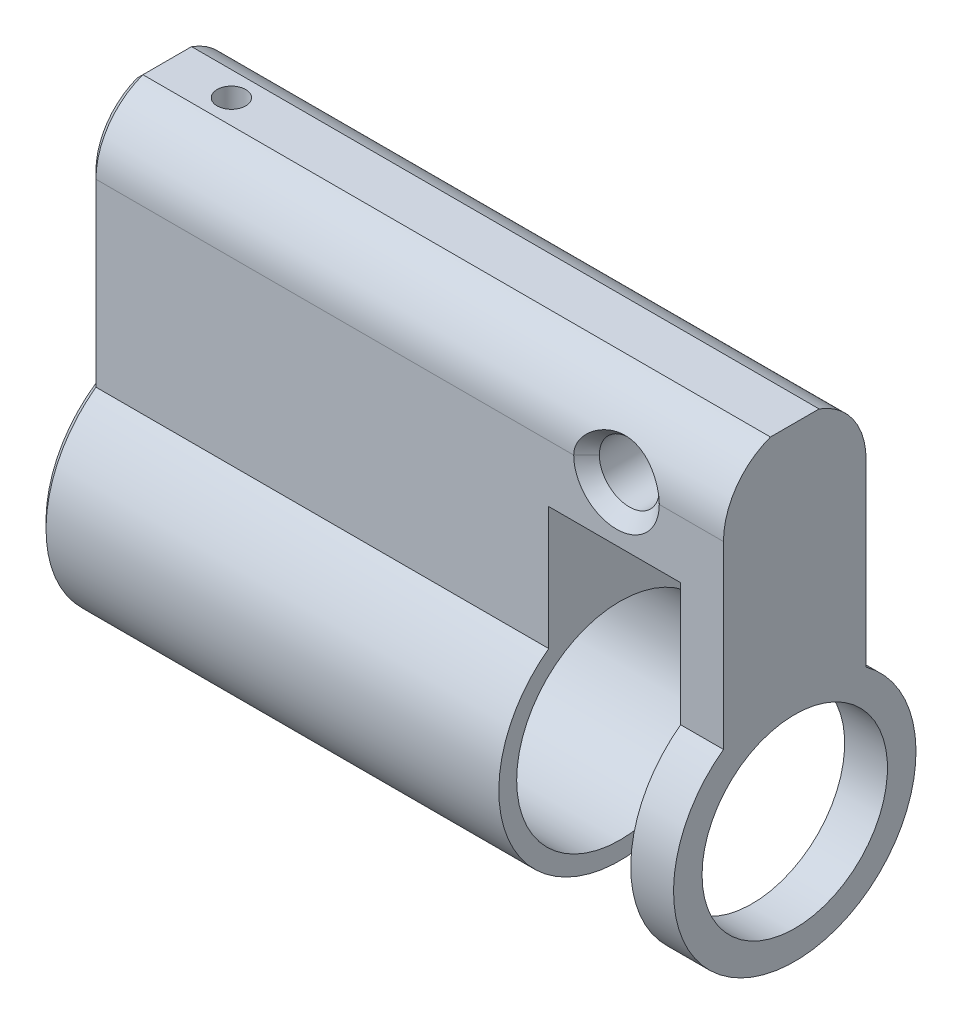
ISO-10303-21;
HEADER;
FILE_DESCRIPTION(('STEP AP214'),'2;1');
FILE_NAME('part.step','',(''),(''),'','','');
FILE_SCHEMA(('AUTOMOTIVE_DESIGN { 1 0 10303 214 1 1 1 1 }'));
ENDSEC;
DATA;
#1=APPLICATION_CONTEXT('core data for automotive mechanical design processes');
#2=APPLICATION_PROTOCOL_DEFINITION('international standard','automotive_design',2000,#1);
#3=PRODUCT_CONTEXT('',#1,'mechanical');
#4=PRODUCT('Part','Part','',(#3));
#5=PRODUCT_RELATED_PRODUCT_CATEGORY('part','',(#4));
#6=PRODUCT_DEFINITION_FORMATION('','',#4);
#7=PRODUCT_DEFINITION_CONTEXT('part definition',#1,'design');
#8=PRODUCT_DEFINITION('design','',#6,#7);
#9=PRODUCT_DEFINITION_SHAPE('','',#8);
#10=(LENGTH_UNIT() NAMED_UNIT(*) SI_UNIT(.MILLI.,.METRE.));
#11=(NAMED_UNIT(*) PLANE_ANGLE_UNIT() SI_UNIT($,.RADIAN.));
#12=(NAMED_UNIT(*) SI_UNIT($,.STERADIAN.) SOLID_ANGLE_UNIT());
#13=UNCERTAINTY_MEASURE_WITH_UNIT(LENGTH_MEASURE(1.E-05),#10,'distance_accuracy_value','');
#14=(GEOMETRIC_REPRESENTATION_CONTEXT(3) GLOBAL_UNCERTAINTY_ASSIGNED_CONTEXT((#13)) GLOBAL_UNIT_ASSIGNED_CONTEXT((#10,
#11,#12)) REPRESENTATION_CONTEXT('',''));
#15=CARTESIAN_POINT('',(0.,0.,0.));
#16=DIRECTION('',(0.,0.,1.));
#17=DIRECTION('',(1.,0.,0.));
#18=AXIS2_PLACEMENT_3D('',#15,#16,#17);
#19=CARTESIAN_POINT('',(37.,19.5,5.));
#20=DIRECTION('',(0.,0.,1.));
#21=DIRECTION('',(1.,0.,0.));
#22=AXIS2_PLACEMENT_3D('',#19,#20,#21);
#23=CYLINDRICAL_SURFACE('',#22,2.1);
#24=CARTESIAN_POINT('',(37.,19.5,4.09999999993715));
#25=DIRECTION('',(0.,0.,1.));
#26=DIRECTION('',(1.,0.,0.));
#27=AXIS2_PLACEMENT_3D('',#24,#25,#26);
#28=CIRCLE('',#27,2.10000000001901);
#29=CARTESIAN_POINT('',(34.9000000000172,19.5,4.09999999990873));
#30=VERTEX_POINT('',#29);
#31=CARTESIAN_POINT('',(39.0999999999858,19.5,4.09999999991821));
#32=VERTEX_POINT('',#31);
#33=EDGE_CURVE('E288',#30,#32,#28,.T.);
#34=ORIENTED_EDGE('',*,*,#33,.T.);
#35=CARTESIAN_POINT('',(37.,19.5,4.09999999993715));
#36=DIRECTION('',(0.,0.,1.));
#37=DIRECTION('',(1.,0.,0.));
#38=AXIS2_PLACEMENT_3D('',#35,#36,#37);
#39=CIRCLE('',#38,2.10000000001901);
#40=EDGE_CURVE('E284',#32,#30,#39,.T.);
#41=ORIENTED_EDGE('',*,*,#40,.T.);
#42=EDGE_LOOP('',(#34,#41));
#43=FACE_BOUND('',#42,.T.);
#44=CARTESIAN_POINT('',(37.,19.5,-4.10000000005084));
#45=DIRECTION('',(0.,0.,-1.));
#46=DIRECTION('',(-1.,0.,0.));
#47=AXIS2_PLACEMENT_3D('',#44,#45,#46);
#48=CIRCLE('',#47,2.10000000006357);
#49=CARTESIAN_POINT('',(34.8999999999364,19.5,-4.10000000005084));
#50=VERTEX_POINT('',#49);
#51=EDGE_CURVE('E283',#50,#50,#48,.T.);
#52=ORIENTED_EDGE('',*,*,#51,.T.);
#53=EDGE_LOOP('',(#52));
#54=FACE_BOUND('',#53,.T.);
#55=ADVANCED_FACE('F17',(#43,#54),#23,.F.);
#56=CARTESIAN_POINT('',(44.5,0.,0.));
#57=DIRECTION('',(-1.,0.,0.));
#58=DIRECTION('',(0.,0.,1.));
#59=AXIS2_PLACEMENT_3D('',#56,#57,#58);
#60=CYLINDRICAL_SURFACE('',#59,6.5);
#61=CARTESIAN_POINT('',(44.5,0.,0.));
#62=DIRECTION('',(-1.,0.,0.));
#63=DIRECTION('',(0.,0.,1.));
#64=AXIS2_PLACEMENT_3D('',#61,#62,#63);
#65=CIRCLE('',#64,6.5);
#66=CARTESIAN_POINT('',(44.5,0.,6.5));
#67=VERTEX_POINT('',#66);
#68=EDGE_CURVE('E291',#67,#67,#65,.T.);
#69=ORIENTED_EDGE('',*,*,#68,.F.);
#70=EDGE_LOOP('',(#69));
#71=FACE_BOUND('',#70,.T.);
#72=CARTESIAN_POINT('',(41.5,0.,0.));
#73=DIRECTION('',(-1.,0.,0.));
#74=DIRECTION('',(0.,0.,1.));
#75=AXIS2_PLACEMENT_3D('',#72,#73,#74);
#76=CIRCLE('',#75,6.5);
#77=CARTESIAN_POINT('',(41.5,0.,6.5));
#78=VERTEX_POINT('',#77);
#79=EDGE_CURVE('E420',#78,#78,#76,.T.);
#80=ORIENTED_EDGE('',*,*,#79,.T.);
#81=EDGE_LOOP('',(#80));
#82=FACE_BOUND('',#81,.T.);
#83=ADVANCED_FACE('F376',(#71,#82),#60,.F.);
#84=CARTESIAN_POINT('',(37.,19.5,5.00539999984539));
#85=DIRECTION('',(0.,0.,1.));
#86=DIRECTION('',(1.,0.,0.));
#87=AXIS2_PLACEMENT_3D('',#84,#85,#86);
#88=CONICAL_SURFACE('',#87,3.00539999992725,0.78539816342884);
#89=ORIENTED_EDGE('',*,*,#40,.F.);
#90=DIRECTION('',(-0.70710678118655,0.,-0.707106781186546));
#91=VECTOR('',#90,1.);
#92=CARTESIAN_POINT('',(499000.,19.5,498964.999999997));
#93=LINE('',#92,#91);
#94=CARTESIAN_POINT('',(40.0000000000489,19.5,4.99999999999659));
#95=VERTEX_POINT('',#94);
#96=EDGE_CURVE('E426',#32,#95,#93,.F.);
#97=ORIENTED_EDGE('',*,*,#96,.T.);
#98=CARTESIAN_POINT('',(33.9999999999199,19.5,5.00000000000343));
#99=CARTESIAN_POINT('',(33.9999854146605,19.5528225823414,5.00000822978084));
#100=CARTESIAN_POINT('',(34.0022316938853,19.6056363700975,4.99916317729062));
#101=CARTESIAN_POINT('',(34.0111336406359,19.7108042339211,4.99582883745809));
#102=CARTESIAN_POINT('',(34.0177863449553,19.7631585949841,4.99334065508124));
#103=CARTESIAN_POINT('',(34.0353228534764,19.8666467403166,4.98680690474662));
#104=CARTESIAN_POINT('',(34.0461744451081,19.9177867445114,4.98277319584288));
#105=CARTESIAN_POINT('',(34.0719065568968,20.0188969298868,4.97326134082751));
#106=CARTESIAN_POINT('',(34.086787584622,20.0688669628297,4.96778301274657));
#107=CARTESIAN_POINT('',(34.137044390166,20.2163089994117,4.94941046813956));
#108=CARTESIAN_POINT('',(34.1780947807403,20.3116589926914,4.93455541766174));
#109=CARTESIAN_POINT('',(34.2731694972842,20.4949890173285,4.90089186162958));
#110=CARTESIAN_POINT('',(34.3272223849256,20.5829522406904,4.88207466421134));
#111=CARTESIAN_POINT('',(34.4714837219082,20.7863295147732,4.83326618091879));
#112=CARTESIAN_POINT('',(34.5672837757614,20.8974678671354,4.80193027192794));
#113=CARTESIAN_POINT('',(34.7756046713651,21.1021289189596,4.73758854489772));
#114=CARTESIAN_POINT('',(34.8881491989768,21.1956262323526,4.70458040575029));
#115=CARTESIAN_POINT('',(35.1282371661669,21.3665847421425,4.63943668619313));
#116=CARTESIAN_POINT('',(35.2560159514255,21.4437237443117,4.60732785243984));
#117=CARTESIAN_POINT('',(35.5217473279444,21.5798726188792,4.54748903850474));
#118=CARTESIAN_POINT('',(35.6596985534591,21.6388849194817,4.51975847206407));
#119=CARTESIAN_POINT('',(35.9713431620296,21.7486084129189,4.46634401069456));
#120=CARTESIAN_POINT('',(36.1467057827306,21.7953633575503,4.44215213999822));
#121=CARTESIAN_POINT('',(36.5037480064608,21.8621924647062,4.40698192873602));
#122=CARTESIAN_POINT('',(36.6854283214082,21.8822636102667,4.39600508232041));
#123=CARTESIAN_POINT('',(37.0527229313458,21.8954235403674,4.38885154307643));
#124=CARTESIAN_POINT('',(37.2383560516724,21.8881164672787,4.39289197614788));
#125=CARTESIAN_POINT('',(37.6055591510559,21.8457803393038,4.41563917308225));
#126=CARTESIAN_POINT('',(37.7871275307215,21.8107405626823,4.43435160925938));
#127=CARTESIAN_POINT('',(38.139816415752,21.7138667062694,4.48349171625867));
#128=CARTESIAN_POINT('',(38.3110032388125,21.6522291263898,4.51383329269228));
#129=CARTESIAN_POINT('',(38.6398475026852,21.5025376092208,4.58220504349375));
#130=CARTESIAN_POINT('',(38.7975062049494,21.4144861383881,4.62023449988036));
#131=CARTESIAN_POINT('',(39.0671706908479,21.230266785056,4.69191714371968));
#132=CARTESIAN_POINT('',(39.1822749412107,21.1384514179893,4.72511683677503));
#133=CARTESIAN_POINT('',(39.396062736459,20.9369322899441,4.7902399688264));
#134=CARTESIAN_POINT('',(39.4947692252981,20.8272539562345,4.82216514277619));
#135=CARTESIAN_POINT('',(39.650882269423,20.6172015241567,4.87450403285088));
#136=CARTESIAN_POINT('',(39.7125852404604,20.5202741691004,4.89589248736086));
#137=CARTESIAN_POINT('',(39.8199820183252,20.3172337904155,4.93383613165072));
#138=CARTESIAN_POINT('',(39.8657181117365,20.2111459723621,4.95040406835083));
#139=CARTESIAN_POINT('',(39.9338143223749,20.0053941913842,4.9753313485891));
#140=CARTESIAN_POINT('',(39.9583675607026,19.906561145412,4.98445303847158));
#141=CARTESIAN_POINT('',(39.9832058671073,19.7557661161589,4.99371206292589));
#142=CARTESIAN_POINT('',(39.9894874544757,19.7048726929359,4.99606155342167));
#143=CARTESIAN_POINT('',(39.9978897125291,19.6026614748258,4.99920846538627));
#144=CARTESIAN_POINT('',(40.0000075163128,19.5513434119576,5.00000481746539));
#145=CARTESIAN_POINT('',(40.0000000000815,19.5,5.));
#146=B_SPLINE_CURVE_WITH_KNOTS('',3,(#98,#99,#100,#101,#102,#103,#104,#105,#106,#107,#108,#109,
#110,#111,#112,#113,#114,#115,#116,#117,#118,#119,#120,#121,#122,#123,#124,#125,#126,#127,#128,
#129,#130,#131,#132,#133,#134,#135,#136,#137,#138,#139,#140,#141,#142,#143,#144,#145),
.UNSPECIFIED.,.F.,.F.,(4,2,2,2,2,2,2,2,2,2,2,2,2,2,2,2,2,2,2,2,2,2,2,4),(0.,0.158398883151843,
0.31669135517533,0.473792792210861,0.630914027757754,0.944113013268993,1.25800636640073,
1.70566148017339,2.15395595241382,2.61039478058119,3.06677243873736,3.6135000563763,
4.16028948370242,4.71501516214164,5.2699554077907,5.82086421799829,6.3717216018545,
6.82289045807166,7.27342261688,7.62272317367181,7.9710914991915,8.27632758411876,
8.43015406623447,8.58408642588058),.UNSPECIFIED.);
#147=CARTESIAN_POINT('',(33.9999999999947,19.5,4.99999999996931));
#148=VERTEX_POINT('',#147);
#149=EDGE_CURVE('E272',#148,#95,#146,.T.);
#150=ORIENTED_EDGE('',*,*,#149,.F.);
#151=DIRECTION('',(0.70710678118655,0.,-0.707106781186546));
#152=VECTOR('',#151,1.);
#153=CARTESIAN_POINT('',(-498926.,19.5000000000611,498964.999999997));
#154=LINE('',#153,#152);
#155=EDGE_CURVE('E292',#148,#30,#154,.T.);
#156=ORIENTED_EDGE('',*,*,#155,.T.);
#157=EDGE_LOOP('',(#89,#97,#150,#156));
#158=FACE_BOUND('',#157,.T.);
#159=ADVANCED_FACE('F370',(#158),#88,.F.);
#160=CARTESIAN_POINT('',(44.5,24.2,1.7058722109232));
#161=DIRECTION('',(0.,-1.,0.));
#162=DIRECTION('',(0.,0.,-1.));
#163=AXIS2_PLACEMENT_3D('',#160,#161,#162);
#164=PLANE('',#163);
#165=DIRECTION('',(0.,0.,1.));
#166=VECTOR('',#165,1.);
#167=CARTESIAN_POINT('',(0.500000000000007,24.2,1.7058722109232));
#168=LINE('',#167,#166);
#169=CARTESIAN_POINT('',(0.500000000030796,24.2000000000083,-1.70587221085203));
#170=VERTEX_POINT('',#169);
#171=CARTESIAN_POINT('',(0.500000000014491,24.2000000000145,1.70587221085312));
#172=VERTEX_POINT('',#171);
#173=EDGE_CURVE('E274',#170,#172,#168,.T.);
#174=ORIENTED_EDGE('',*,*,#173,.T.);
#175=DIRECTION('',(-1.,0.,0.));
#176=VECTOR('',#175,1.);
#177=CARTESIAN_POINT('',(44.5,24.2,1.7058722109232));
#178=LINE('',#177,#176);
#179=CARTESIAN_POINT('',(44.5,24.2,1.7058722109232));
#180=VERTEX_POINT('',#179);
#181=EDGE_CURVE('E269',#180,#172,#178,.T.);
#182=ORIENTED_EDGE('',*,*,#181,.F.);
#183=DIRECTION('',(0.,0.,-1.));
#184=VECTOR('',#183,1.);
#185=CARTESIAN_POINT('',(44.5,24.2,0.));
#186=LINE('',#185,#184);
#187=CARTESIAN_POINT('',(44.5,24.2,-1.7058722109232));
#188=VERTEX_POINT('',#187);
#189=EDGE_CURVE('E409',#188,#180,#186,.F.);
#190=ORIENTED_EDGE('',*,*,#189,.F.);
#191=DIRECTION('',(-1.,0.,0.));
#192=VECTOR('',#191,1.);
#193=CARTESIAN_POINT('',(44.5,24.2,-1.7058722109232));
#194=LINE('',#193,#192);
#195=EDGE_CURVE('E281',#170,#188,#194,.F.);
#196=ORIENTED_EDGE('',*,*,#195,.F.);
#197=EDGE_LOOP('',(#174,#182,#190,#196));
#198=FACE_BOUND('',#197,.T.);
#199=CARTESIAN_POINT('',(5.,24.2,0.));
#200=DIRECTION('',(0.,-1.,0.));
#201=DIRECTION('',(0.,0.,-1.));
#202=AXIS2_PLACEMENT_3D('',#199,#200,#201);
#203=CIRCLE('',#202,1.);
#204=CARTESIAN_POINT('',(5.,24.2,-1.));
#205=VERTEX_POINT('',#204);
#206=EDGE_CURVE('E428',#205,#205,#203,.T.);
#207=ORIENTED_EDGE('',*,*,#206,.T.);
#208=EDGE_LOOP('',(#207));
#209=FACE_BOUND('',#208,.T.);
#210=ADVANCED_FACE('F375',(#198,#209),#164,.F.);
#211=CARTESIAN_POINT('',(37.,19.5,-4.99999999988177));
#212=DIRECTION('',(0.,0.,-1.));
#213=DIRECTION('',(-1.,0.,0.));
#214=AXIS2_PLACEMENT_3D('',#211,#212,#213);
#215=CONICAL_SURFACE('',#214,2.9999999998945,0.785398163397448);
#216=CARTESIAN_POINT('',(37.,19.5,-4.99999999999545));
#217=DIRECTION('',(0.,0.,-1.));
#218=DIRECTION('',(-1.,0.,0.));
#219=AXIS2_PLACEMENT_3D('',#216,#217,#218);
#220=CIRCLE('',#219,3.00000000000818);
#221=CARTESIAN_POINT('',(39.9999999998826,19.5,-4.99999999989711));
#222=VERTEX_POINT('',#221);
#223=CARTESIAN_POINT('',(34.0000000000314,19.5,-4.99999999996817));
#224=VERTEX_POINT('',#223);
#225=EDGE_CURVE('E110',#222,#224,#220,.T.);
#226=ORIENTED_EDGE('',*,*,#225,.T.);
#227=CARTESIAN_POINT('',(40.0000000000127,19.5,-5.));
#228=CARTESIAN_POINT('',(40.0000145852713,19.5528225823416,-5.00000822977961));
#229=CARTESIAN_POINT('',(39.997768306046,19.6056363700979,-4.99916317729028));
#230=CARTESIAN_POINT('',(39.9888663592952,19.7108042339218,-4.99582883745839));
#231=CARTESIAN_POINT('',(39.9822136549759,19.7631585949851,-4.99334065508128));
#232=CARTESIAN_POINT('',(39.9646771464549,19.866646740318,-4.98680690474643));
#233=CARTESIAN_POINT('',(39.9538255548231,19.917786744513,-4.98277319584272));
#234=CARTESIAN_POINT('',(39.9280934430345,20.0188969298888,-4.97326134082732));
#235=CARTESIAN_POINT('',(39.9132124153093,20.068866962832,-4.96778301274632));
#236=CARTESIAN_POINT('',(39.8629556097652,20.2163089994146,-4.94941046813913));
#237=CARTESIAN_POINT('',(39.8219052191909,20.3116589926948,-4.93455541766119));
#238=CARTESIAN_POINT('',(39.7268305026468,20.4949890173327,-4.90089186162873));
#239=CARTESIAN_POINT('',(39.6727776150052,20.582952240695,-4.88207466421032));
#240=CARTESIAN_POINT('',(39.5285162780233,20.786329514777,-4.83326618091775));
#241=CARTESIAN_POINT('',(39.4327162241711,20.8974678671381,-4.80193027192712));
#242=CARTESIAN_POINT('',(39.2243953285695,21.1021289189604,-4.73758854489743));
#243=CARTESIAN_POINT('',(39.1118508009589,21.1956262323525,-4.70458040575031));
#244=CARTESIAN_POINT('',(38.8717628337712,21.3665847421403,-4.63943668619396));
#245=CARTESIAN_POINT('',(38.743984048514,21.4437237443084,-4.60732785244118));
#246=CARTESIAN_POINT('',(38.4782526719978,21.5798726188737,-4.54748903850722));
#247=CARTESIAN_POINT('',(38.3403014464845,21.6388849194751,-4.51975847206719));
#248=CARTESIAN_POINT('',(38.0286568379196,21.7486084129087,-4.46634401069966));
#249=CARTESIAN_POINT('',(37.853294217223,21.795363357538,-4.44215214000455));
#250=CARTESIAN_POINT('',(37.4962519935018,21.8621924646903,-4.40698192874455));
#251=CARTESIAN_POINT('',(37.3145716785591,21.8822636102492,-4.39600508232992));
#252=CARTESIAN_POINT('',(36.9472770686322,21.8954235403472,-4.38885154308748));
#253=CARTESIAN_POINT('',(36.7616439483118,21.8881164672575,-4.39289197615942));
#254=CARTESIAN_POINT('',(36.3944408489406,21.8457803392815,-4.41563917309408));
#255=CARTESIAN_POINT('',(36.2128724692812,21.81074056266,-4.434351609271));
#256=CARTESIAN_POINT('',(35.8601835842628,21.7138667062478,-4.48349171626935));
#257=CARTESIAN_POINT('',(35.6889967612082,21.6522291263689,-4.51383329270222));
#258=CARTESIAN_POINT('',(35.360152497347,21.5025376092023,-4.58220504350183));
#259=CARTESIAN_POINT('',(35.2024937950885,21.4144861383712,-4.62023449988731));
#260=CARTESIAN_POINT('',(34.9328293091977,21.2302667850416,-4.69191714372499));
#261=CARTESIAN_POINT('',(34.8177250588372,21.1384514179754,-4.72511683677987));
#262=CARTESIAN_POINT('',(34.6039372635937,20.9369322899312,-4.79023996883025));
#263=CARTESIAN_POINT('',(34.5052307747569,20.8272539562223,-4.82216514277952));
#264=CARTESIAN_POINT('',(34.3491177306352,20.617201524145,-4.87450403285356));
#265=CARTESIAN_POINT('',(34.2874147595988,20.5202741690884,-4.89589248736338));
#266=CARTESIAN_POINT('',(34.1800179817362,20.3172337904028,-4.93383613165282));
#267=CARTESIAN_POINT('',(34.134281888326,20.2111459723492,-4.95040406835269));
#268=CARTESIAN_POINT('',(34.0661856776903,20.0053941913729,-4.97533134859021));
#269=CARTESIAN_POINT('',(34.0416324393639,19.9065611454028,-4.98445303847228));
#270=CARTESIAN_POINT('',(34.0167941329605,19.755766116153,-4.99371206292618));
#271=CARTESIAN_POINT('',(34.0105125455925,19.7048726929312,-4.99606155342186));
#272=CARTESIAN_POINT('',(34.0021102875396,19.6026614748234,-4.99920846538631));
#273=CARTESIAN_POINT('',(33.999992483756,19.5513434119564,-5.00000481746539));
#274=CARTESIAN_POINT('',(33.9999999999873,19.5,-5.));
#275=B_SPLINE_CURVE_WITH_KNOTS('',3,(#227,#228,#229,#230,#231,#232,#233,#234,#235,#236,#237,
#238,#239,#240,#241,#242,#243,#244,#245,#246,#247,#248,#249,#250,#251,#252,#253,#254,#255,#256,
#257,#258,#259,#260,#261,#262,#263,#264,#265,#266,#267,#268,#269,#270,#271,#272,#273,#274),
.UNSPECIFIED.,.F.,.F.,(4,2,2,2,2,2,2,2,2,2,2,2,2,2,2,2,2,2,2,2,2,2,2,4),(0.,0.158398883152431,
0.316691355176518,0.473792792212691,0.63091402776022,0.944113013272763,1.25800636640578,
1.70566148017409,2.15395595241016,2.61039478057208,3.06677243872281,3.61350005634717,
4.1602894836587,4.71501516207984,5.26995540771078,5.82086421790098,6.37172160173984,
6.82289045795051,7.27342261675239,7.62272317354341,7.97109149906236,8.2763275839828,
8.43015406609496,8.58408642573749),.UNSPECIFIED.);
#276=EDGE_CURVE('E21',#222,#224,#275,.T.);
#277=ORIENTED_EDGE('',*,*,#276,.F.);
#278=EDGE_LOOP('',(#226,#277));
#279=FACE_BOUND('',#278,.T.);
#280=ORIENTED_EDGE('',*,*,#51,.F.);
#281=EDGE_LOOP('',(#280));
#282=FACE_BOUND('',#281,.T.);
#283=ADVANCED_FACE('F489',(#279,#282),#215,.F.);
#284=CARTESIAN_POINT('',(44.5,19.5,0.));
#285=DIRECTION('',(-1.,0.,0.));
#286=DIRECTION('',(0.,0.,1.));
#287=AXIS2_PLACEMENT_3D('',#284,#285,#286);
#288=CYLINDRICAL_SURFACE('',#287,5.);
#289=DIRECTION('',(1.,0.,0.));
#290=VECTOR('',#289,1.);
#291=CARTESIAN_POINT('',(44.5,19.5,-5.));
#292=LINE('',#291,#290);
#293=CARTESIAN_POINT('',(44.5,19.5,-5.));
#294=VERTEX_POINT('',#293);
#295=EDGE_CURVE('E213',#294,#222,#292,.F.);
#296=ORIENTED_EDGE('',*,*,#295,.T.);
#297=ORIENTED_EDGE('',*,*,#276,.T.);
#298=DIRECTION('',(1.,0.,0.));
#299=VECTOR('',#298,1.);
#300=CARTESIAN_POINT('',(44.5,19.5,-5.));
#301=LINE('',#300,#299);
#302=CARTESIAN_POINT('',(0.500000000022514,19.5,-4.99999999999773));
#303=VERTEX_POINT('',#302);
#304=EDGE_CURVE('E207',#224,#303,#301,.F.);
#305=ORIENTED_EDGE('',*,*,#304,.T.);
#306=CARTESIAN_POINT('',(0.50000000004502,19.5,0.));
#307=DIRECTION('',(1.,0.,0.));
#308=DIRECTION('',(0.,0.,-1.));
#309=AXIS2_PLACEMENT_3D('',#306,#307,#308);
#310=CIRCLE('',#309,4.99999999999545);
#311=EDGE_CURVE('E230',#170,#303,#310,.F.);
#312=ORIENTED_EDGE('',*,*,#311,.F.);
#313=ORIENTED_EDGE('',*,*,#195,.T.);
#314=CARTESIAN_POINT('',(44.5,19.5,0.));
#315=DIRECTION('',(-1.,0.,0.));
#316=DIRECTION('',(0.,0.,1.));
#317=AXIS2_PLACEMENT_3D('',#314,#315,#316);
#318=CIRCLE('',#317,5.);
#319=EDGE_CURVE('E416',#294,#188,#318,.F.);
#320=ORIENTED_EDGE('',*,*,#319,.F.);
#321=EDGE_LOOP('',(#296,#297,#305,#312,#313,#320));
#322=FACE_BOUND('',#321,.T.);
#323=ADVANCED_FACE('F447',(#322),#288,.T.);
#324=CARTESIAN_POINT('',(5.,35.,0.));
#325=DIRECTION('',(0.,-1.,0.));
#326=DIRECTION('',(0.,0.,-1.));
#327=AXIS2_PLACEMENT_3D('',#324,#325,#326);
#328=CYLINDRICAL_SURFACE('',#327,1.);
#329=ORIENTED_EDGE('',*,*,#206,.F.);
#330=EDGE_LOOP('',(#329));
#331=FACE_BOUND('',#330,.T.);
#332=CARTESIAN_POINT('',(5.,7.18070330817254,-1.));
#333=CARTESIAN_POINT('',(5.05583092252824,7.18070420570197,-0.999997506706467));
#334=CARTESIAN_POINT('',(5.11173446976674,7.18136201154282,-0.995304779072233));
#335=CARTESIAN_POINT('',(5.22202199965267,7.1839223009072,-0.976650254365614));
#336=CARTESIAN_POINT('',(5.27640259960566,7.18582735643132,-0.96266930281722));
#337=CARTESIAN_POINT('',(5.38197256228186,7.19066240463804,-0.925859795407067));
#338=CARTESIAN_POINT('',(5.43316544636477,7.19359124184075,-0.903041210919993));
#339=CARTESIAN_POINT('',(5.53097288710094,7.20014221161936,-0.849225114023525));
#340=CARTESIAN_POINT('',(5.57758927697457,7.20376406486301,-0.818230895047748));
#341=CARTESIAN_POINT('',(5.66526623272058,7.21132142593411,-0.748712082836381));
#342=CARTESIAN_POINT('',(5.70629076937359,7.21525873004016,-0.710142236079476));
#343=CARTESIAN_POINT('',(5.78130865352364,7.22298742540225,-0.626662894468755));
#344=CARTESIAN_POINT('',(5.81530127930559,7.2267788016486,-0.581752749678083));
#345=CARTESIAN_POINT('',(5.87541639727752,7.2338064638837,-0.486645016443903));
#346=CARTESIAN_POINT('',(5.90150666788128,7.23704045467194,-0.436426877485283));
#347=CARTESIAN_POINT('',(5.9448695594005,7.24256952535023,-0.332269959615617));
#348=CARTESIAN_POINT('',(5.96214265280799,7.24486465555033,-0.278331380250192));
#349=CARTESIAN_POINT('',(5.98727451278554,7.2482449934304,-0.168628174356074));
#350=CARTESIAN_POINT('',(5.99519243776723,7.24933780106679,-0.11287733835884));
#351=CARTESIAN_POINT('',(6.00157270774973,7.25021636609379,-0.000828218561136006));
#352=CARTESIAN_POINT('',(6.00003548461855,7.25000218318176,0.0554700401182938));
#353=CARTESIAN_POINT('',(5.98759617112012,7.24829701300697,0.166612247564157));
#354=CARTESIAN_POINT('',(5.9767577976581,7.24681471310824,0.221463479817656));
#355=CARTESIAN_POINT('',(5.94612348829491,7.24274954674007,0.328561574289506));
#356=CARTESIAN_POINT('',(5.92632727431407,7.24016664610466,0.380808355601572));
#357=CARTESIAN_POINT('',(5.8782719612081,7.23417542571909,0.481410661479399));
#358=CARTESIAN_POINT('',(5.84998538055084,7.23076443256776,0.529752893021716));
#359=CARTESIAN_POINT('',(5.78577472563159,7.2234982994777,0.621024615889332));
#360=CARTESIAN_POINT('',(5.74985083498755,7.219643170218,0.663954237306316));
#361=CARTESIAN_POINT('',(5.67103655780434,7.21188207614354,0.743553924039967));
#362=CARTESIAN_POINT('',(5.62809189378762,7.20797595287442,0.780170246035541));
#363=CARTESIAN_POINT('',(5.53661527448014,7.20058201770957,0.84570097026846));
#364=CARTESIAN_POINT('',(5.48808078661362,7.19709439689708,0.874611861599064));
#365=CARTESIAN_POINT('',(5.38673742735358,7.19093211489438,0.923913396640632));
#366=CARTESIAN_POINT('',(5.33392267964184,7.18825859616053,0.944292081714915));
#367=CARTESIAN_POINT('',(5.22564617801063,7.18404523080903,0.975833625406255));
#368=CARTESIAN_POINT('',(5.17019029176125,7.18250298553394,0.987015989271698));
#369=CARTESIAN_POINT('',(5.09529016075649,7.18131021812896,0.995633398101801));
#370=CARTESIAN_POINT('',(5.07627201577249,7.18108310616462,0.997269612547973));
#371=CARTESIAN_POINT('',(5.03817207755431,7.18077949769804,0.999453340067789));
#372=CARTESIAN_POINT('',(5.01909028428454,7.18070300128002,1.00000085253261));
#373=CARTESIAN_POINT('',(4.94416907747175,7.18070420570198,0.999997506706467));
#374=CARTESIAN_POINT('',(4.88826553023326,7.18136201154282,0.995304779072233));
#375=CARTESIAN_POINT('',(4.77797800034733,7.1839223009072,0.976650254365614));
#376=CARTESIAN_POINT('',(4.72359740039434,7.18582735643132,0.962669302817219));
#377=CARTESIAN_POINT('',(4.61802743771814,7.19066240463804,0.925859795407066));
#378=CARTESIAN_POINT('',(4.56683455363522,7.19359124184075,0.903041210919992));
#379=CARTESIAN_POINT('',(4.46902711289905,7.20014221161936,0.849225114023524));
#380=CARTESIAN_POINT('',(4.42241072302543,7.20376406486301,0.818230895047747));
#381=CARTESIAN_POINT('',(4.33473376727942,7.21132142593411,0.74871208283638));
#382=CARTESIAN_POINT('',(4.29370923062641,7.21525873004016,0.710142236079476));
#383=CARTESIAN_POINT('',(4.21869134647636,7.22298742540225,0.626662894468754));
#384=CARTESIAN_POINT('',(4.18469872069441,7.2267788016486,0.581752749678082));
#385=CARTESIAN_POINT('',(4.12458360272248,7.2338064638837,0.486645016443901));
#386=CARTESIAN_POINT('',(4.09849333211872,7.23704045467194,0.436426877485282));
#387=CARTESIAN_POINT('',(4.0551304405995,7.24256952535023,0.332269959615615));
#388=CARTESIAN_POINT('',(4.03785734719201,7.24486465555033,0.27833138025019));
#389=CARTESIAN_POINT('',(4.01272548721446,7.2482449934304,0.168628174356073));
#390=CARTESIAN_POINT('',(4.00480756223277,7.24933780106679,0.112877338358838));
#391=CARTESIAN_POINT('',(3.99842729225027,7.25021636609379,0.000828218561134434));
#392=CARTESIAN_POINT('',(3.99996451538145,7.25000218318176,-0.0554700401182953));
#393=CARTESIAN_POINT('',(4.01240382887988,7.24829701300697,-0.166612247564158));
#394=CARTESIAN_POINT('',(4.0232422023419,7.24681471310824,-0.221463479817657));
#395=CARTESIAN_POINT('',(4.05387651170509,7.24274954674007,-0.328561574289508));
#396=CARTESIAN_POINT('',(4.07367272568593,7.24016664610466,-0.380808355601573));
#397=CARTESIAN_POINT('',(4.1217280387919,7.23417542571909,-0.481410661479401));
#398=CARTESIAN_POINT('',(4.15001461944916,7.23076443256776,-0.529752893021718));
#399=CARTESIAN_POINT('',(4.21422527436841,7.2234982994777,-0.621024615889333));
#400=CARTESIAN_POINT('',(4.25014916501245,7.219643170218,-0.663954237306318));
#401=CARTESIAN_POINT('',(4.32896344219566,7.21188207614354,-0.743553924039969));
#402=CARTESIAN_POINT('',(4.37190810621238,7.20797595287442,-0.780170246035542));
#403=CARTESIAN_POINT('',(4.46338472551986,7.20058201770957,-0.845700970268461));
#404=CARTESIAN_POINT('',(4.51191921338638,7.19709439689708,-0.874611861599065));
#405=CARTESIAN_POINT('',(4.61326257264643,7.19093211489438,-0.923913396640633));
#406=CARTESIAN_POINT('',(4.66607732035816,7.18825859616053,-0.944292081714916));
#407=CARTESIAN_POINT('',(4.77435382198937,7.18404523080903,-0.975833625406256));
#408=CARTESIAN_POINT('',(4.82980970823875,7.18250298553394,-0.987015989271699));
#409=CARTESIAN_POINT('',(4.90470983924351,7.18131021812896,-0.995633398101801));
#410=CARTESIAN_POINT('',(4.92372798422751,7.18108310616462,-0.997269612547973));
#411=CARTESIAN_POINT('',(4.96182792244569,7.18077949769804,-0.999453340067789));
#412=CARTESIAN_POINT('',(4.98090971571546,7.18070300128002,-1.00000085253261));
#413=CARTESIAN_POINT('',(5.,7.18070330817254,-1.));
#414=B_SPLINE_CURVE_WITH_KNOTS('',3,(#332,#333,#334,#335,#336,#337,#338,#339,#340,#341,#342,
#343,#344,#345,#346,#347,#348,#349,#350,#351,#352,#353,#354,#355,#356,#357,#358,#359,#360,#361,
#362,#363,#364,#365,#366,#367,#368,#369,#370,#371,#372,#373,#374,#375,#376,#377,#378,#379,#380,
#381,#382,#383,#384,#385,#386,#387,#388,#389,#390,#391,#392,#393,#394,#395,#396,#397,#398,#399,
#400,#401,#402,#403,#404,#405,#406,#407,#408,#409,#410,#411,#412,#413),.UNSPECIFIED.,.T.,.F.,(4,
2,2,2,2,2,2,2,2,2,2,2,2,2,2,2,2,2,2,2,2,2,2,2,2,2,2,2,2,2,2,2,2,2,2,2,2,2,2,2,4),(0.,
0.167419967640368,0.335186270355509,0.502763833614685,0.670273993548006,0.838817012224232,
1.00737732061855,1.1766159517186,1.34584551276148,1.51399910540938,1.68214501762573,
1.84914816955725,2.01615650614986,2.18371135233679,2.35126217058733,2.5201755530237,
2.68916576818061,2.85839205142962,3.02725847599042,3.08450440432427,3.14175036467082,
3.30917033231119,3.47693663502633,3.6445141982855,3.81202435821882,3.98056737689505,
4.14912768528937,4.31836631638942,4.4875958774323,4.6557494700802,4.82389538229655,
4.99089853422807,5.15790687082068,5.32546171700761,5.49301253525815,5.66192591769452,
5.83091613285143,6.00014241610044,6.16900884066124,6.22625476899509,6.28350072934163),.UNSPECIFIED.);
#415=CARTESIAN_POINT('',(5.,7.18070330817254,-1.));
#416=VERTEX_POINT('',#415);
#417=EDGE_CURVE('E304',#416,#416,#414,.T.);
#418=ORIENTED_EDGE('',*,*,#417,.T.);
#419=EDGE_LOOP('',(#418));
#420=FACE_BOUND('',#419,.T.);
#421=ADVANCED_FACE('F312',(#331,#420),#328,.F.);
#422=CARTESIAN_POINT('',(37.,19.5,4.99999999988177));
#423=DIRECTION('',(0.,0.,1.));
#424=DIRECTION('',(1.,0.,0.));
#425=AXIS2_PLACEMENT_3D('',#422,#423,#424);
#426=CONICAL_SURFACE('',#425,2.99999999990678,0.785398163397448);
#427=ORIENTED_EDGE('',*,*,#155,.F.);
#428=CARTESIAN_POINT('',(37.,19.5,4.99999999993861));
#429=DIRECTION('',(0.,0.,1.));
#430=DIRECTION('',(1.,0.,0.));
#431=AXIS2_PLACEMENT_3D('',#428,#429,#430);
#432=CIRCLE('',#431,2.99999999996362);
#433=EDGE_CURVE('E187',#148,#95,#432,.T.);
#434=ORIENTED_EDGE('',*,*,#433,.T.);
#435=ORIENTED_EDGE('',*,*,#96,.F.);
#436=ORIENTED_EDGE('',*,*,#33,.F.);
#437=EDGE_LOOP('',(#427,#434,#435,#436));
#438=FACE_BOUND('',#437,.T.);
#439=ADVANCED_FACE('F481',(#438),#426,.F.);
#440=CARTESIAN_POINT('',(44.5,0.,0.));
#441=DIRECTION('',(1.,0.,0.));
#442=DIRECTION('',(0.,0.,-1.));
#443=AXIS2_PLACEMENT_3D('',#440,#441,#442);
#444=PLANE('',#443);
#445=CARTESIAN_POINT('',(44.5,19.5,0.));
#446=DIRECTION('',(-1.,0.,0.));
#447=DIRECTION('',(0.,0.,1.));
#448=AXIS2_PLACEMENT_3D('',#445,#446,#447);
#449=CIRCLE('',#448,5.);
#450=CARTESIAN_POINT('',(44.5,19.5,5.));
#451=VERTEX_POINT('',#450);
#452=EDGE_CURVE('E231',#451,#180,#449,.T.);
#453=ORIENTED_EDGE('',*,*,#452,.F.);
#454=DIRECTION('',(0.,1.,0.));
#455=VECTOR('',#454,1.);
#456=CARTESIAN_POINT('',(44.5,19.5,5.));
#457=LINE('',#456,#455);
#458=CARTESIAN_POINT('',(44.5,6.87386354243376,5.));
#459=VERTEX_POINT('',#458);
#460=EDGE_CURVE('E186',#451,#459,#457,.F.);
#461=ORIENTED_EDGE('',*,*,#460,.T.);
#462=CARTESIAN_POINT('',(44.5,0.,0.));
#463=DIRECTION('',(-1.,0.,0.));
#464=DIRECTION('',(0.,0.,1.));
#465=AXIS2_PLACEMENT_3D('',#462,#463,#464);
#466=CIRCLE('',#465,8.5);
#467=CARTESIAN_POINT('',(44.5,6.87386354243376,-5.));
#468=VERTEX_POINT('',#467);
#469=EDGE_CURVE('E417',#468,#459,#466,.T.);
#470=ORIENTED_EDGE('',*,*,#469,.F.);
#471=DIRECTION('',(0.,-1.,0.));
#472=VECTOR('',#471,1.);
#473=CARTESIAN_POINT('',(44.5,19.5,-5.));
#474=LINE('',#473,#472);
#475=EDGE_CURVE('E215',#468,#294,#474,.F.);
#476=ORIENTED_EDGE('',*,*,#475,.T.);
#477=ORIENTED_EDGE('',*,*,#319,.T.);
#478=ORIENTED_EDGE('',*,*,#189,.T.);
#479=EDGE_LOOP('',(#453,#461,#470,#476,#477,#478));
#480=FACE_BOUND('',#479,.T.);
#481=ORIENTED_EDGE('',*,*,#68,.T.);
#482=EDGE_LOOP('',(#481));
#483=FACE_BOUND('',#482,.T.);
#484=ADVANCED_FACE('F413',(#480,#483),#444,.T.);
#485=CARTESIAN_POINT('',(44.5,0.,0.));
#486=DIRECTION('',(-1.,0.,0.));
#487=DIRECTION('',(0.,0.,1.));
#488=AXIS2_PLACEMENT_3D('',#485,#486,#487);
#489=CYLINDRICAL_SURFACE('',#488,8.5);
#490=DIRECTION('',(1.,0.,0.));
#491=VECTOR('',#490,1.);
#492=CARTESIAN_POINT('',(44.5,6.87386354243376,5.));
#493=LINE('',#492,#491);
#494=CARTESIAN_POINT('',(41.5,6.87386354243376,5.));
#495=VERTEX_POINT('',#494);
#496=EDGE_CURVE('E465',#459,#495,#493,.F.);
#497=ORIENTED_EDGE('',*,*,#496,.T.);
#498=CARTESIAN_POINT('',(41.5,0.,0.));
#499=DIRECTION('',(-1.,0.,0.));
#500=DIRECTION('',(0.,0.,1.));
#501=AXIS2_PLACEMENT_3D('',#498,#499,#500);
#502=CIRCLE('',#501,8.5);
#503=CARTESIAN_POINT('',(41.5,6.87386354243376,-5.));
#504=VERTEX_POINT('',#503);
#505=EDGE_CURVE('E273',#495,#504,#502,.F.);
#506=ORIENTED_EDGE('',*,*,#505,.T.);
#507=DIRECTION('',(1.,0.,0.));
#508=VECTOR('',#507,1.);
#509=CARTESIAN_POINT('',(44.5,6.87386354243376,-5.));
#510=LINE('',#509,#508);
#511=EDGE_CURVE('E259',#504,#468,#510,.T.);
#512=ORIENTED_EDGE('',*,*,#511,.T.);
#513=ORIENTED_EDGE('',*,*,#469,.T.);
#514=EDGE_LOOP('',(#497,#506,#512,#513));
#515=FACE_BOUND('',#514,.T.);
#516=ADVANCED_FACE('F441',(#515),#489,.T.);
#517=CARTESIAN_POINT('',(41.5,-8.5,-8.5));
#518=DIRECTION('',(1.,0.,0.));
#519=DIRECTION('',(0.,0.,-1.));
#520=AXIS2_PLACEMENT_3D('',#517,#518,#519);
#521=PLANE('',#520);
#522=DIRECTION('',(0.,1.,0.));
#523=VECTOR('',#522,1.);
#524=CARTESIAN_POINT('',(41.5,19.5,5.));
#525=LINE('',#524,#523);
#526=CARTESIAN_POINT('',(41.5,15.5,5.));
#527=VERTEX_POINT('',#526);
#528=EDGE_CURVE('E195',#495,#527,#525,.T.);
#529=ORIENTED_EDGE('',*,*,#528,.T.);
#530=DIRECTION('',(0.,0.,1.));
#531=VECTOR('',#530,1.);
#532=CARTESIAN_POINT('',(41.5,15.5,-8.5));
#533=LINE('',#532,#531);
#534=CARTESIAN_POINT('',(41.5,15.5,-5.));
#535=VERTEX_POINT('',#534);
#536=EDGE_CURVE('E218',#527,#535,#533,.F.);
#537=ORIENTED_EDGE('',*,*,#536,.T.);
#538=DIRECTION('',(0.,-1.,0.));
#539=VECTOR('',#538,1.);
#540=CARTESIAN_POINT('',(41.5,19.5,-5.));
#541=LINE('',#540,#539);
#542=EDGE_CURVE('E117',#535,#504,#541,.T.);
#543=ORIENTED_EDGE('',*,*,#542,.T.);
#544=ORIENTED_EDGE('',*,*,#505,.F.);
#545=EDGE_LOOP('',(#529,#537,#543,#544));
#546=FACE_BOUND('',#545,.T.);
#547=ORIENTED_EDGE('',*,*,#79,.F.);
#548=EDGE_LOOP('',(#547));
#549=FACE_BOUND('',#548,.T.);
#550=ADVANCED_FACE('F360',(#546,#549),#521,.F.);
#551=CARTESIAN_POINT('',(44.5,19.5,0.));
#552=DIRECTION('',(-1.,0.,0.));
#553=DIRECTION('',(0.,0.,1.));
#554=AXIS2_PLACEMENT_3D('',#551,#552,#553);
#555=CYLINDRICAL_SURFACE('',#554,5.);
#556=DIRECTION('',(1.,0.,0.));
#557=VECTOR('',#556,1.);
#558=CARTESIAN_POINT('',(44.5,19.5,5.));
#559=LINE('',#558,#557);
#560=EDGE_CURVE('E183',#95,#451,#559,.T.);
#561=ORIENTED_EDGE('',*,*,#560,.T.);
#562=ORIENTED_EDGE('',*,*,#452,.T.);
#563=ORIENTED_EDGE('',*,*,#181,.T.);
#564=CARTESIAN_POINT('',(0.50000000004502,19.5,0.));
#565=DIRECTION('',(1.,0.,0.));
#566=DIRECTION('',(0.,0.,-1.));
#567=AXIS2_PLACEMENT_3D('',#564,#565,#566);
#568=CIRCLE('',#567,4.99999999999545);
#569=CARTESIAN_POINT('',(0.500000000011261,19.5,4.99999999999886));
#570=VERTEX_POINT('',#569);
#571=EDGE_CURVE('E159',#570,#172,#568,.F.);
#572=ORIENTED_EDGE('',*,*,#571,.F.);
#573=DIRECTION('',(1.,0.,0.));
#574=VECTOR('',#573,1.);
#575=CARTESIAN_POINT('',(44.5,19.5,5.));
#576=LINE('',#575,#574);
#577=EDGE_CURVE('E178',#570,#148,#576,.T.);
#578=ORIENTED_EDGE('',*,*,#577,.T.);
#579=ORIENTED_EDGE('',*,*,#149,.T.);
#580=EDGE_LOOP('',(#561,#562,#563,#572,#578,#579));
#581=FACE_BOUND('',#580,.T.);
#582=ADVANCED_FACE('F355',(#581),#555,.T.);
#583=CARTESIAN_POINT('',(0.500000000000007,19.5,-5.));
#584=DIRECTION('',(0.707106781186548,0.,0.707106781186547));
#585=DIRECTION('',(0.707106781186547,0.,-0.707106781186548));
#586=AXIS2_PLACEMENT_3D('',#583,#584,#585);
#587=PLANE('',#586);
#588=DIRECTION('',(0.,-1.,0.));
#589=VECTOR('',#588,1.);
#590=CARTESIAN_POINT('',(0.500000000000007,19.5,-5.));
#591=LINE('',#590,#589);
#592=CARTESIAN_POINT('',(0.500000000000008,6.87386354243376,-5.));
#593=VERTEX_POINT('',#592);
#594=EDGE_CURVE('E210',#303,#593,#591,.T.);
#595=ORIENTED_EDGE('',*,*,#594,.T.);
#596=CARTESIAN_POINT('',(0.,6.61437827766148,-4.49999999999999));
#597=CARTESIAN_POINT('',(0.0203228345136849,6.6251321100289,-4.52032283198493));
#598=CARTESIAN_POINT('',(0.0406517616636985,6.6358629647109,-4.54065172847119));
#599=CARTESIAN_POINT('',(0.0814536647315964,6.65734878906313,-4.58145354685227));
#600=CARTESIAN_POINT('',(0.101926718674157,6.66810346268289,-4.60192654662133));
#601=CARTESIAN_POINT('',(0.143016874317338,6.68963655893263,-4.64301660405126));
#602=CARTESIAN_POINT('',(0.163634053143225,6.70041468708057,-4.66363373890503));
#603=CARTESIAN_POINT('',(0.205012459958362,6.72199434030752,-4.70501208517879));
#604=CARTESIAN_POINT('',(0.225773764219422,6.73279557254373,-4.72577337304803));
#605=CARTESIAN_POINT('',(0.267440422583028,6.75442109588661,-4.76744003207807));
#606=CARTESIAN_POINT('',(0.288345852128463,6.76524509585912,-4.78834547889542));
#607=CARTESIAN_POINT('',(0.33030076203389,6.78691583076232,-4.83030045023757));
#608=CARTESIAN_POINT('',(0.35135031703801,6.7977622763356,-4.85135004957594));
#609=CARTESIAN_POINT('',(0.393593478210372,6.81947759292236,-4.8935933085854));
#610=CARTESIAN_POINT('',(0.41478715824739,6.83034617642279,-4.91478704218115));
#611=CARTESIAN_POINT('',(0.457318571884177,6.85210547348612,-4.95731853976671));
#612=CARTESIAN_POINT('',(0.478656378616667,6.86299590144429,-4.97865637674247));
#613=CARTESIAN_POINT('',(0.500000000000008,6.87386354243376,-5.));
#614=B_SPLINE_CURVE_WITH_KNOTS('',3,(#596,#597,#598,#599,#600,#601,#602,#603,#604,#605,#606,
#607,#608,#609,#610,#611,#612,#613),.UNSPECIFIED.,.F.,.F.,(4,2,2,2,2,2,2,2,4),(0.,
0.0920604043435256,0.184718737769687,0.277974912291995,0.371828829908085,0.46628038279875,
0.561329453523455,0.656975915212477,0.753219631755923),.UNSPECIFIED.);
#615=CARTESIAN_POINT('',(0.,6.61437827766148,-4.49999999999999));
#616=VERTEX_POINT('',#615);
#617=EDGE_CURVE('E158',#616,#593,#614,.T.);
#618=ORIENTED_EDGE('',*,*,#617,.F.);
#619=DIRECTION('',(0.,1.,0.));
#620=VECTOR('',#619,1.);
#621=CARTESIAN_POINT('',(0.,0.,-4.49999999999999));
#622=LINE('',#621,#620);
#623=CARTESIAN_POINT('',(0.,19.5,-4.50000000000363));
#624=VERTEX_POINT('',#623);
#625=EDGE_CURVE('E174',#616,#624,#622,.T.);
#626=ORIENTED_EDGE('',*,*,#625,.T.);
#627=DIRECTION('',(-0.707106781186548,0.,0.707106781186547));
#628=VECTOR('',#627,1.);
#629=CARTESIAN_POINT('',(498995.5,19.5,-499000.));
#630=LINE('',#629,#628);
#631=EDGE_CURVE('E227',#303,#624,#630,.T.);
#632=ORIENTED_EDGE('',*,*,#631,.F.);
#633=EDGE_LOOP('',(#595,#618,#626,#632));
#634=FACE_BOUND('',#633,.T.);
#635=ADVANCED_FACE('F351',(#634),#587,.F.);
#636=CARTESIAN_POINT('',(0.50000000004502,19.5,0.));
#637=DIRECTION('',(1.,0.,0.));
#638=DIRECTION('',(0.,0.,-1.));
#639=AXIS2_PLACEMENT_3D('',#636,#637,#638);
#640=CONICAL_SURFACE('',#639,4.99999999999545,0.785398163340605);
#641=CARTESIAN_POINT('',(-1.14585143582645E-12,23.6999999999988,-1.61554944216043));
#642=CARTESIAN_POINT('',(0.0832969705674252,23.7832969705674,-1.63100596799805));
#643=CARTESIAN_POINT('',(0.166612128926771,23.8666121289268,-1.64626112942789));
#644=CARTESIAN_POINT('',(0.333278795610502,24.0332787956105,-1.67636871884449));
#645=CARTESIAN_POINT('',(0.416630303923706,24.1166303039237,-1.69122114695505));
#646=CARTESIAN_POINT('',(0.500000000016503,24.2000000000165,-1.70587221078162));
#647=B_SPLINE_CURVE_WITH_KNOTS('',3,(#641,#642,#643,#644,#645,#646),.UNSPECIFIED.,.F.,.F.,(4,2,
4),(0.,0.356426655254943,0.712853200945024),.UNSPECIFIED.);
#648=CARTESIAN_POINT('',(0.,23.7000000000032,-1.61554944215236));
#649=VERTEX_POINT('',#648);
#650=EDGE_CURVE('E276',#649,#170,#647,.T.);
#651=ORIENTED_EDGE('',*,*,#650,.T.);
#652=ORIENTED_EDGE('',*,*,#311,.T.);
#653=ORIENTED_EDGE('',*,*,#631,.T.);
#654=CARTESIAN_POINT('',(0.,19.5,0.));
#655=DIRECTION('',(1.,0.,0.));
#656=DIRECTION('',(0.,0.,-1.));
#657=AXIS2_PLACEMENT_3D('',#654,#655,#656);
#658=CIRCLE('',#657,4.50000000000728);
#659=EDGE_CURVE('E173',#624,#649,#658,.T.);
#660=ORIENTED_EDGE('',*,*,#659,.T.);
#661=EDGE_LOOP('',(#651,#652,#653,#660));
#662=FACE_BOUND('',#661,.T.);
#663=ADVANCED_FACE('F347',(#662),#640,.T.);
#664=CARTESIAN_POINT('',(0.500000000000007,24.2,1.7058722109232));
#665=DIRECTION('',(0.707106781186548,-0.707106781186548,0.));
#666=DIRECTION('',(0.707106781186548,0.707106781186548,0.));
#667=AXIS2_PLACEMENT_3D('',#664,#665,#666);
#668=PLANE('',#667);
#669=DIRECTION('',(0.,0.,-1.));
#670=VECTOR('',#669,1.);
#671=CARTESIAN_POINT('',(0.,23.6999999999998,0.));
#672=LINE('',#671,#670);
#673=CARTESIAN_POINT('',(0.,23.6999999999999,1.61554944215105));
#674=VERTEX_POINT('',#673);
#675=EDGE_CURVE('E150',#649,#674,#672,.F.);
#676=ORIENTED_EDGE('',*,*,#675,.T.);
#677=CARTESIAN_POINT('',(0.500000000031089,24.2000000000269,1.70587221078267));
#678=CARTESIAN_POINT('',(0.416630303935381,24.1166303039333,1.69122114695625));
#679=CARTESIAN_POINT('',(0.33327879561962,24.0332787956189,1.67636871884576));
#680=CARTESIAN_POINT('',(0.166612128931485,23.8666121289322,1.64626112942913));
#681=CARTESIAN_POINT('',(0.0832969705702924,23.783296970571,1.63100596799919));
#682=CARTESIAN_POINT('',(2.28129923865316E-13,23.7000000000002,1.61554944216139));
#683=B_SPLINE_CURVE_WITH_KNOTS('',3,(#677,#678,#679,#680,#681,#682),.UNSPECIFIED.,.F.,.F.,(4,2,
4),(0.,0.356426545697896,0.712853200960647),.UNSPECIFIED.);
#684=EDGE_CURVE('E145',#172,#674,#683,.T.);
#685=ORIENTED_EDGE('',*,*,#684,.F.);
#686=ORIENTED_EDGE('',*,*,#173,.F.);
#687=ORIENTED_EDGE('',*,*,#650,.F.);
#688=EDGE_LOOP('',(#676,#685,#686,#687));
#689=FACE_BOUND('',#688,.T.);
#690=ADVANCED_FACE('F334',(#689),#668,.F.);
#691=CARTESIAN_POINT('',(0.50000000004502,19.5,0.));
#692=DIRECTION('',(1.,0.,0.));
#693=DIRECTION('',(0.,0.,-1.));
#694=AXIS2_PLACEMENT_3D('',#691,#692,#693);
#695=CONICAL_SURFACE('',#694,4.99999999999545,0.785398163340605);
#696=DIRECTION('',(-0.707106781186547,0.,-0.707106781186548));
#697=VECTOR('',#696,1.);
#698=CARTESIAN_POINT('',(0.500000000000007,19.5,5.));
#699=LINE('',#698,#697);
#700=CARTESIAN_POINT('',(0.,19.5,4.49999999999999));
#701=VERTEX_POINT('',#700);
#702=EDGE_CURVE('E142',#701,#570,#699,.F.);
#703=ORIENTED_EDGE('',*,*,#702,.T.);
#704=ORIENTED_EDGE('',*,*,#571,.T.);
#705=ORIENTED_EDGE('',*,*,#684,.T.);
#706=CARTESIAN_POINT('',(0.,19.5,0.));
#707=DIRECTION('',(1.,0.,0.));
#708=DIRECTION('',(0.,0.,-1.));
#709=AXIS2_PLACEMENT_3D('',#706,#707,#708);
#710=CIRCLE('',#709,4.50000000000728);
#711=EDGE_CURVE('E138',#674,#701,#710,.T.);
#712=ORIENTED_EDGE('',*,*,#711,.T.);
#713=EDGE_LOOP('',(#703,#704,#705,#712));
#714=FACE_BOUND('',#713,.T.);
#715=ADVANCED_FACE('F140',(#714),#695,.T.);
#716=CARTESIAN_POINT('',(0.500000000000007,19.5,5.));
#717=DIRECTION('',(0.707106781186548,0.,-0.707106781186547));
#718=DIRECTION('',(-0.707106781186547,0.,-0.707106781186548));
#719=AXIS2_PLACEMENT_3D('',#716,#717,#718);
#720=PLANE('',#719);
#721=DIRECTION('',(0.,1.,0.));
#722=VECTOR('',#721,1.);
#723=CARTESIAN_POINT('',(0.,0.,4.49999999999999));
#724=LINE('',#723,#722);
#725=CARTESIAN_POINT('',(0.,6.61437827766148,4.49999999999999));
#726=VERTEX_POINT('',#725);
#727=EDGE_CURVE('E149',#701,#726,#724,.F.);
#728=ORIENTED_EDGE('',*,*,#727,.T.);
#729=CARTESIAN_POINT('',(0.500000000000008,6.87386354243376,5.));
#730=CARTESIAN_POINT('',(0.478656378616668,6.86299590144429,4.97865637674247));
#731=CARTESIAN_POINT('',(0.457318571884176,6.85210547348612,4.9573185397667));
#732=CARTESIAN_POINT('',(0.414787158247387,6.83034617642279,4.91478704218115));
#733=CARTESIAN_POINT('',(0.393593478210368,6.81947759292236,4.8935933085854));
#734=CARTESIAN_POINT('',(0.351350317038005,6.7977622763356,4.85135004957593));
#735=CARTESIAN_POINT('',(0.330300762033885,6.78691583076231,4.83030045023757));
#736=CARTESIAN_POINT('',(0.288345852128458,6.76524509585911,4.78834547889542));
#737=CARTESIAN_POINT('',(0.267440422583023,6.7544210958866,4.76744003207807));
#738=CARTESIAN_POINT('',(0.225773764219416,6.73279557254372,4.72577337304803));
#739=CARTESIAN_POINT('',(0.205012459958357,6.72199434030752,4.70501208517878));
#740=CARTESIAN_POINT('',(0.16363405314322,6.70041468708057,4.66363373890502));
#741=CARTESIAN_POINT('',(0.143016874317333,6.68963655893263,4.64301660405125));
#742=CARTESIAN_POINT('',(0.101926718674153,6.66810346268289,4.60192654662132));
#743=CARTESIAN_POINT('',(0.0814536647315933,6.65734878906313,4.58145354685226));
#744=CARTESIAN_POINT('',(0.0406517616636969,6.6358629647109,4.54065172847119));
#745=CARTESIAN_POINT('',(0.0203228345136841,6.6251321100289,4.52032283198492));
#746=CARTESIAN_POINT('',(0.,6.61437827766148,4.49999999999999));
#747=B_SPLINE_CURVE_WITH_KNOTS('',3,(#729,#730,#731,#732,#733,#734,#735,#736,#737,#738,#739,
#740,#741,#742,#743,#744,#745,#746),.UNSPECIFIED.,.F.,.F.,(4,2,2,2,2,2,2,2,4),(0.,
0.0962437165434504,0.191890178232472,0.286939248957181,0.381390801847846,0.475244719463936,
0.568500893986244,0.661159227412403,0.753219631755924),.UNSPECIFIED.);
#748=CARTESIAN_POINT('',(0.500000000000008,6.87386354243376,5.));
#749=VERTEX_POINT('',#748);
#750=EDGE_CURVE('E177',#749,#726,#747,.T.);
#751=ORIENTED_EDGE('',*,*,#750,.F.);
#752=DIRECTION('',(0.,1.,0.));
#753=VECTOR('',#752,1.);
#754=CARTESIAN_POINT('',(0.500000000000007,19.5,5.));
#755=LINE('',#754,#753);
#756=EDGE_CURVE('E156',#749,#570,#755,.T.);
#757=ORIENTED_EDGE('',*,*,#756,.T.);
#758=ORIENTED_EDGE('',*,*,#702,.F.);
#759=EDGE_LOOP('',(#728,#751,#757,#758));
#760=FACE_BOUND('',#759,.T.);
#761=ADVANCED_FACE('F154',(#760),#720,.F.);
#762=CARTESIAN_POINT('',(44.5,19.5,-5.));
#763=DIRECTION('',(0.,0.,1.));
#764=DIRECTION('',(0.,-1.,0.));
#765=AXIS2_PLACEMENT_3D('',#762,#763,#764);
#766=PLANE('',#765);
#767=ORIENTED_EDGE('',*,*,#594,.F.);
#768=ORIENTED_EDGE('',*,*,#304,.F.);
#769=ORIENTED_EDGE('',*,*,#225,.F.);
#770=ORIENTED_EDGE('',*,*,#295,.F.);
#771=ORIENTED_EDGE('',*,*,#475,.F.);
#772=ORIENTED_EDGE('',*,*,#511,.F.);
#773=ORIENTED_EDGE('',*,*,#542,.F.);
#774=DIRECTION('',(1.,0.,0.));
#775=VECTOR('',#774,1.);
#776=CARTESIAN_POINT('',(32.25,15.5,-5.));
#777=LINE('',#776,#775);
#778=CARTESIAN_POINT('',(32.25,15.5,-5.));
#779=VERTEX_POINT('',#778);
#780=EDGE_CURVE('E216',#535,#779,#777,.F.);
#781=ORIENTED_EDGE('',*,*,#780,.T.);
#782=DIRECTION('',(0.,1.,0.));
#783=VECTOR('',#782,1.);
#784=CARTESIAN_POINT('',(32.25,-8.5,-5.));
#785=LINE('',#784,#783);
#786=CARTESIAN_POINT('',(32.25,6.87386354243376,-5.));
#787=VERTEX_POINT('',#786);
#788=EDGE_CURVE('E206',#779,#787,#785,.F.);
#789=ORIENTED_EDGE('',*,*,#788,.T.);
#790=DIRECTION('',(-1.,0.,0.));
#791=VECTOR('',#790,1.);
#792=CARTESIAN_POINT('',(44.5,6.87386354243376,-5.));
#793=LINE('',#792,#791);
#794=EDGE_CURVE('E167',#593,#787,#793,.F.);
#795=ORIENTED_EDGE('',*,*,#794,.F.);
#796=EDGE_LOOP('',(#767,#768,#769,#770,#771,#772,#773,#781,#789,#795));
#797=FACE_BOUND('',#796,.T.);
#798=ADVANCED_FACE('F325',(#797),#766,.F.);
#799=CARTESIAN_POINT('',(32.25,15.5,-8.5));
#800=DIRECTION('',(0.,1.,0.));
#801=DIRECTION('',(0.,0.,1.));
#802=AXIS2_PLACEMENT_3D('',#799,#800,#801);
#803=PLANE('',#802);
#804=DIRECTION('',(1.,0.,0.));
#805=VECTOR('',#804,1.);
#806=CARTESIAN_POINT('',(44.5,15.5,5.));
#807=LINE('',#806,#805);
#808=CARTESIAN_POINT('',(32.25,15.5,5.));
#809=VERTEX_POINT('',#808);
#810=EDGE_CURVE('E192',#527,#809,#807,.F.);
#811=ORIENTED_EDGE('',*,*,#810,.T.);
#812=DIRECTION('',(0.,0.,1.));
#813=VECTOR('',#812,1.);
#814=CARTESIAN_POINT('',(32.25,15.5,-8.5));
#815=LINE('',#814,#813);
#816=EDGE_CURVE('E198',#809,#779,#815,.F.);
#817=ORIENTED_EDGE('',*,*,#816,.T.);
#818=ORIENTED_EDGE('',*,*,#780,.F.);
#819=ORIENTED_EDGE('',*,*,#536,.F.);
#820=EDGE_LOOP('',(#811,#817,#818,#819));
#821=FACE_BOUND('',#820,.T.);
#822=ADVANCED_FACE('F321',(#821),#803,.F.);
#823=CARTESIAN_POINT('',(37.,0.,0.));
#824=DIRECTION('',(-1.,0.,0.));
#825=DIRECTION('',(0.,0.,1.));
#826=AXIS2_PLACEMENT_3D('',#823,#824,#825);
#827=CYLINDRICAL_SURFACE('',#826,7.25);
#828=CARTESIAN_POINT('',(0.,0.,0.));
#829=DIRECTION('',(-1.,0.,0.));
#830=DIRECTION('',(0.,0.,1.));
#831=AXIS2_PLACEMENT_3D('',#828,#829,#830);
#832=CIRCLE('',#831,7.25);
#833=CARTESIAN_POINT('',(0.,0.,7.25));
#834=VERTEX_POINT('',#833);
#835=EDGE_CURVE('E164',#834,#834,#832,.T.);
#836=ORIENTED_EDGE('',*,*,#835,.T.);
#837=EDGE_LOOP('',(#836));
#838=FACE_BOUND('',#837,.T.);
#839=CARTESIAN_POINT('',(32.25,0.,0.));
#840=DIRECTION('',(-1.,0.,0.));
#841=DIRECTION('',(0.,0.,1.));
#842=AXIS2_PLACEMENT_3D('',#839,#840,#841);
#843=CIRCLE('',#842,7.25);
#844=CARTESIAN_POINT('',(32.25,0.,7.25));
#845=VERTEX_POINT('',#844);
#846=EDGE_CURVE('E191',#845,#845,#843,.F.);
#847=ORIENTED_EDGE('',*,*,#846,.T.);
#848=EDGE_LOOP('',(#847));
#849=FACE_BOUND('',#848,.T.);
#850=ORIENTED_EDGE('',*,*,#417,.F.);
#851=EDGE_LOOP('',(#850));
#852=FACE_BOUND('',#851,.T.);
#853=ADVANCED_FACE('F315',(#838,#849,#852),#827,.F.);
#854=CARTESIAN_POINT('',(44.5,19.5,5.));
#855=DIRECTION('',(0.,0.,-1.));
#856=DIRECTION('',(0.,1.,0.));
#857=AXIS2_PLACEMENT_3D('',#854,#855,#856);
#858=PLANE('',#857);
#859=ORIENTED_EDGE('',*,*,#756,.F.);
#860=DIRECTION('',(-1.,0.,0.));
#861=VECTOR('',#860,1.);
#862=CARTESIAN_POINT('',(44.5,6.87386354243376,5.));
#863=LINE('',#862,#861);
#864=CARTESIAN_POINT('',(32.25,6.87386354243376,5.));
#865=VERTEX_POINT('',#864);
#866=EDGE_CURVE('E188',#865,#749,#863,.T.);
#867=ORIENTED_EDGE('',*,*,#866,.F.);
#868=DIRECTION('',(0.,1.,0.));
#869=VECTOR('',#868,1.);
#870=CARTESIAN_POINT('',(32.25,-8.5,5.));
#871=LINE('',#870,#869);
#872=EDGE_CURVE('E201',#865,#809,#871,.T.);
#873=ORIENTED_EDGE('',*,*,#872,.T.);
#874=ORIENTED_EDGE('',*,*,#810,.F.);
#875=ORIENTED_EDGE('',*,*,#528,.F.);
#876=ORIENTED_EDGE('',*,*,#496,.F.);
#877=ORIENTED_EDGE('',*,*,#460,.F.);
#878=ORIENTED_EDGE('',*,*,#560,.F.);
#879=ORIENTED_EDGE('',*,*,#433,.F.);
#880=ORIENTED_EDGE('',*,*,#577,.F.);
#881=EDGE_LOOP('',(#859,#867,#873,#874,#875,#876,#877,#878,#879,#880));
#882=FACE_BOUND('',#881,.T.);
#883=ADVANCED_FACE('F320',(#882),#858,.F.);
#884=CARTESIAN_POINT('',(0.,0.,0.));
#885=DIRECTION('',(1.,0.,0.));
#886=DIRECTION('',(0.,0.,-1.));
#887=AXIS2_PLACEMENT_3D('',#884,#885,#886);
#888=PLANE('',#887);
#889=ORIENTED_EDGE('',*,*,#835,.F.);
#890=EDGE_LOOP('',(#889));
#891=FACE_BOUND('',#890,.T.);
#892=CARTESIAN_POINT('',(0.,0.,0.));
#893=DIRECTION('',(1.,0.,0.));
#894=DIRECTION('',(0.,0.,-1.));
#895=AXIS2_PLACEMENT_3D('',#892,#893,#894);
#896=CIRCLE('',#895,7.99999999999999);
#897=EDGE_CURVE('E163',#726,#616,#896,.T.);
#898=ORIENTED_EDGE('',*,*,#897,.F.);
#899=ORIENTED_EDGE('',*,*,#727,.F.);
#900=ORIENTED_EDGE('',*,*,#711,.F.);
#901=ORIENTED_EDGE('',*,*,#675,.F.);
#902=ORIENTED_EDGE('',*,*,#659,.F.);
#903=ORIENTED_EDGE('',*,*,#625,.F.);
#904=EDGE_LOOP('',(#898,#899,#900,#901,#902,#903));
#905=FACE_BOUND('',#904,.T.);
#906=ADVANCED_FACE('F161',(#891,#905),#888,.F.);
#907=CARTESIAN_POINT('',(32.25,-8.5,-8.5));
#908=DIRECTION('',(-1.,0.,0.));
#909=DIRECTION('',(0.,0.,1.));
#910=AXIS2_PLACEMENT_3D('',#907,#908,#909);
#911=PLANE('',#910);
#912=ORIENTED_EDGE('',*,*,#846,.F.);
#913=EDGE_LOOP('',(#912));
#914=FACE_BOUND('',#913,.T.);
#915=ORIENTED_EDGE('',*,*,#872,.F.);
#916=CARTESIAN_POINT('',(32.25,0.,0.));
#917=DIRECTION('',(-1.,0.,0.));
#918=DIRECTION('',(0.,0.,1.));
#919=AXIS2_PLACEMENT_3D('',#916,#917,#918);
#920=CIRCLE('',#919,8.5);
#921=EDGE_CURVE('E31',#787,#865,#920,.T.);
#922=ORIENTED_EDGE('',*,*,#921,.F.);
#923=ORIENTED_EDGE('',*,*,#788,.F.);
#924=ORIENTED_EDGE('',*,*,#816,.F.);
#925=EDGE_LOOP('',(#915,#922,#923,#924));
#926=FACE_BOUND('',#925,.T.);
#927=ADVANCED_FACE('F252',(#914,#926),#911,.F.);
#928=CARTESIAN_POINT('',(0.500000000000008,0.,0.));
#929=DIRECTION('',(1.,0.,0.));
#930=DIRECTION('',(0.,0.,-1.));
#931=AXIS2_PLACEMENT_3D('',#928,#929,#930);
#932=CONICAL_SURFACE('',#931,8.5,0.785398163397448);
#933=ORIENTED_EDGE('',*,*,#897,.T.);
#934=ORIENTED_EDGE('',*,*,#617,.T.);
#935=CARTESIAN_POINT('',(0.500000000000007,0.,0.));
#936=DIRECTION('',(-1.,0.,0.));
#937=DIRECTION('',(0.,0.,1.));
#938=AXIS2_PLACEMENT_3D('',#935,#936,#937);
#939=CIRCLE('',#938,8.5);
#940=EDGE_CURVE('E11',#749,#593,#939,.F.);
#941=ORIENTED_EDGE('',*,*,#940,.F.);
#942=ORIENTED_EDGE('',*,*,#750,.T.);
#943=EDGE_LOOP('',(#933,#934,#941,#942));
#944=FACE_BOUND('',#943,.T.);
#945=ADVANCED_FACE('F241',(#944),#932,.T.);
#946=CARTESIAN_POINT('',(44.5,0.,0.));
#947=DIRECTION('',(-1.,0.,0.));
#948=DIRECTION('',(0.,0.,1.));
#949=AXIS2_PLACEMENT_3D('',#946,#947,#948);
#950=CYLINDRICAL_SURFACE('',#949,8.5);
#951=ORIENTED_EDGE('',*,*,#921,.T.);
#952=ORIENTED_EDGE('',*,*,#866,.T.);
#953=ORIENTED_EDGE('',*,*,#940,.T.);
#954=ORIENTED_EDGE('',*,*,#794,.T.);
#955=EDGE_LOOP('',(#951,#952,#953,#954));
#956=FACE_BOUND('',#955,.T.);
#957=ADVANCED_FACE('F251',(#956),#950,.T.);
#958=CLOSED_SHELL('',(#55,#83,#159,#210,#283,#323,#421,#439,#484,#516,#550,#582,#635,#663,#690,
#715,#761,#798,#822,#853,#883,#906,#927,#945,#957));
#959=MANIFOLD_SOLID_BREP('B1',#958);
#960=ADVANCED_BREP_SHAPE_REPRESENTATION('',(#18,#959),#14);
#961=SHAPE_DEFINITION_REPRESENTATION(#9,#960);
ENDSEC;
END-ISO-10303-21;
